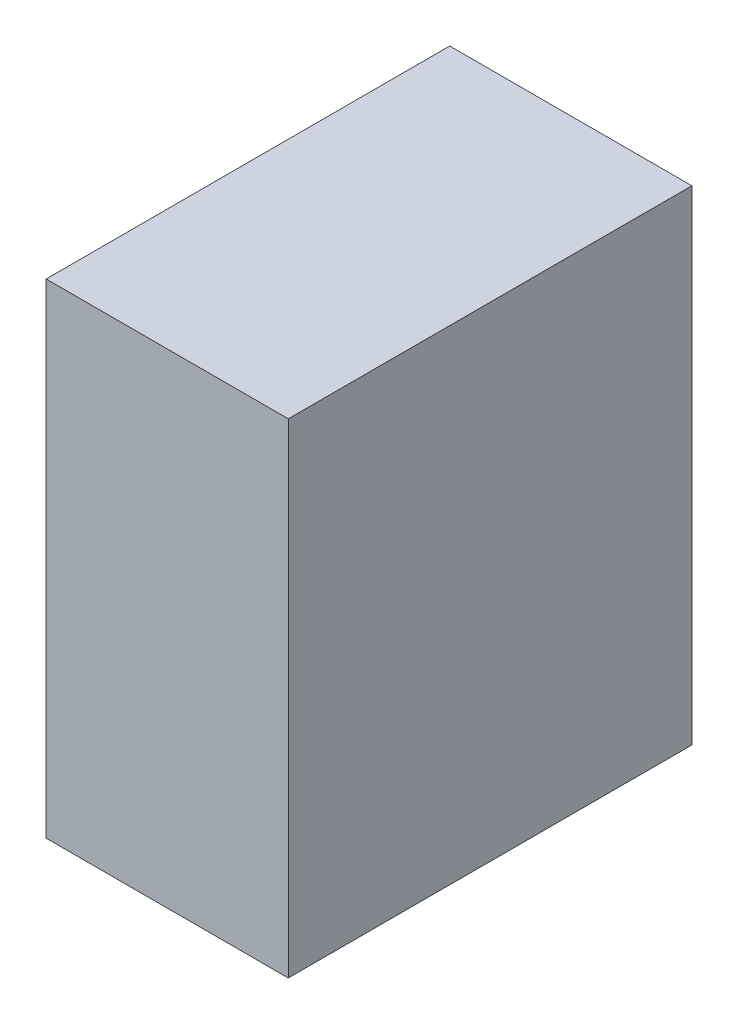
ISO-10303-21;
HEADER;
FILE_DESCRIPTION(('STEP AP214'),'2;1');
FILE_NAME('part.step','',(''),(''),'','','');
FILE_SCHEMA(('AUTOMOTIVE_DESIGN { 1 0 10303 214 1 1 1 1 }'));
ENDSEC;
DATA;
#1=APPLICATION_CONTEXT('core data for automotive mechanical design processes');
#2=APPLICATION_PROTOCOL_DEFINITION('international standard','automotive_design',2000,#1);
#3=PRODUCT_CONTEXT('',#1,'mechanical');
#4=PRODUCT('Part','Part','',(#3));
#5=PRODUCT_RELATED_PRODUCT_CATEGORY('part','',(#4));
#6=PRODUCT_DEFINITION_FORMATION('','',#4);
#7=PRODUCT_DEFINITION_CONTEXT('part definition',#1,'design');
#8=PRODUCT_DEFINITION('design','',#6,#7);
#9=PRODUCT_DEFINITION_SHAPE('','',#8);
#10=(LENGTH_UNIT() NAMED_UNIT(*) SI_UNIT(.MILLI.,.METRE.));
#11=(NAMED_UNIT(*) PLANE_ANGLE_UNIT() SI_UNIT($,.RADIAN.));
#12=(NAMED_UNIT(*) SI_UNIT($,.STERADIAN.) SOLID_ANGLE_UNIT());
#13=UNCERTAINTY_MEASURE_WITH_UNIT(LENGTH_MEASURE(1.E-05),#10,'distance_accuracy_value','');
#14=(GEOMETRIC_REPRESENTATION_CONTEXT(3) GLOBAL_UNCERTAINTY_ASSIGNED_CONTEXT((#13)) GLOBAL_UNIT_ASSIGNED_CONTEXT((#10,
#11,#12)) REPRESENTATION_CONTEXT('',''));
#15=CARTESIAN_POINT('',(0.,0.,0.));
#16=DIRECTION('',(0.,0.,1.));
#17=DIRECTION('',(1.,0.,0.));
#18=AXIS2_PLACEMENT_3D('',#15,#16,#17);
#19=CARTESIAN_POINT('',(38.1,152.4,-63.5));
#20=DIRECTION('',(-1.,0.,0.));
#21=DIRECTION('',(0.,0.,1.));
#22=AXIS2_PLACEMENT_3D('',#19,#20,#21);
#23=PLANE('',#22);
#24=DIRECTION('',(0.,0.,-1.));
#25=VECTOR('',#24,1.);
#26=CARTESIAN_POINT('',(38.1,0.,-63.5));
#27=LINE('',#26,#25);
#28=CARTESIAN_POINT('',(38.1,0.,63.5));
#29=VERTEX_POINT('',#28);
#30=CARTESIAN_POINT('',(38.1,0.,-63.5));
#31=VERTEX_POINT('',#30);
#32=EDGE_CURVE('E98',#29,#31,#27,.T.);
#33=ORIENTED_EDGE('',*,*,#32,.T.);
#34=DIRECTION('',(0.,-1.,0.));
#35=VECTOR('',#34,1.);
#36=CARTESIAN_POINT('',(38.1,152.4,-63.5));
#37=LINE('',#36,#35);
#38=CARTESIAN_POINT('',(38.1,152.4,-63.5));
#39=VERTEX_POINT('',#38);
#40=EDGE_CURVE('E11',#39,#31,#37,.T.);
#41=ORIENTED_EDGE('',*,*,#40,.F.);
#42=DIRECTION('',(0.,0.,-1.));
#43=VECTOR('',#42,1.);
#44=CARTESIAN_POINT('',(38.1,152.4,-63.5));
#45=LINE('',#44,#43);
#46=CARTESIAN_POINT('',(38.1,152.4,63.5));
#47=VERTEX_POINT('',#46);
#48=EDGE_CURVE('E86',#47,#39,#45,.T.);
#49=ORIENTED_EDGE('',*,*,#48,.F.);
#50=DIRECTION('',(0.,-1.,0.));
#51=VECTOR('',#50,1.);
#52=CARTESIAN_POINT('',(38.1,152.4,63.5));
#53=LINE('',#52,#51);
#54=EDGE_CURVE('E94',#47,#29,#53,.T.);
#55=ORIENTED_EDGE('',*,*,#54,.T.);
#56=EDGE_LOOP('',(#33,#41,#49,#55));
#57=FACE_BOUND('',#56,.T.);
#58=ADVANCED_FACE('F35',(#57),#23,.F.);
#59=CARTESIAN_POINT('',(-38.1,152.4,-63.5));
#60=DIRECTION('',(0.,0.,1.));
#61=DIRECTION('',(1.,0.,0.));
#62=AXIS2_PLACEMENT_3D('',#59,#60,#61);
#63=PLANE('',#62);
#64=DIRECTION('',(-1.,0.,0.));
#65=VECTOR('',#64,1.);
#66=CARTESIAN_POINT('',(-38.1,0.,-63.5));
#67=LINE('',#66,#65);
#68=CARTESIAN_POINT('',(-38.1,0.,-63.5));
#69=VERTEX_POINT('',#68);
#70=EDGE_CURVE('E90',#31,#69,#67,.T.);
#71=ORIENTED_EDGE('',*,*,#70,.T.);
#72=DIRECTION('',(0.,-1.,0.));
#73=VECTOR('',#72,1.);
#74=CARTESIAN_POINT('',(-38.1,152.4,-63.5));
#75=LINE('',#74,#73);
#76=CARTESIAN_POINT('',(-38.1,152.4,-63.5));
#77=VERTEX_POINT('',#76);
#78=EDGE_CURVE('E43',#77,#69,#75,.T.);
#79=ORIENTED_EDGE('',*,*,#78,.F.);
#80=DIRECTION('',(-1.,0.,0.));
#81=VECTOR('',#80,1.);
#82=CARTESIAN_POINT('',(-38.1,152.4,-63.5));
#83=LINE('',#82,#81);
#84=EDGE_CURVE('E81',#39,#77,#83,.T.);
#85=ORIENTED_EDGE('',*,*,#84,.F.);
#86=ORIENTED_EDGE('',*,*,#40,.T.);
#87=EDGE_LOOP('',(#71,#79,#85,#86));
#88=FACE_BOUND('',#87,.T.);
#89=ADVANCED_FACE('F89',(#88),#63,.F.);
#90=CARTESIAN_POINT('',(-38.1,152.4,-63.5));
#91=DIRECTION('',(1.,0.,0.));
#92=DIRECTION('',(0.,0.,-1.));
#93=AXIS2_PLACEMENT_3D('',#90,#91,#92);
#94=PLANE('',#93);
#95=DIRECTION('',(0.,0.,1.));
#96=VECTOR('',#95,1.);
#97=CARTESIAN_POINT('',(-38.1,0.,-63.5));
#98=LINE('',#97,#96);
#99=CARTESIAN_POINT('',(-38.1,0.,63.5));
#100=VERTEX_POINT('',#99);
#101=EDGE_CURVE('E68',#69,#100,#98,.T.);
#102=ORIENTED_EDGE('',*,*,#101,.T.);
#103=DIRECTION('',(0.,-1.,0.));
#104=VECTOR('',#103,1.);
#105=CARTESIAN_POINT('',(-38.1,152.4,63.5));
#106=LINE('',#105,#104);
#107=CARTESIAN_POINT('',(-38.1,152.4,63.5));
#108=VERTEX_POINT('',#107);
#109=EDGE_CURVE('E91',#108,#100,#106,.T.);
#110=ORIENTED_EDGE('',*,*,#109,.F.);
#111=DIRECTION('',(0.,0.,1.));
#112=VECTOR('',#111,1.);
#113=CARTESIAN_POINT('',(-38.1,152.4,-63.5));
#114=LINE('',#113,#112);
#115=EDGE_CURVE('E84',#77,#108,#114,.T.);
#116=ORIENTED_EDGE('',*,*,#115,.F.);
#117=ORIENTED_EDGE('',*,*,#78,.T.);
#118=EDGE_LOOP('',(#102,#110,#116,#117));
#119=FACE_BOUND('',#118,.T.);
#120=ADVANCED_FACE('F92',(#119),#94,.F.);
#121=CARTESIAN_POINT('',(-38.1,152.4,63.5));
#122=DIRECTION('',(0.,0.,-1.));
#123=DIRECTION('',(-1.,0.,0.));
#124=AXIS2_PLACEMENT_3D('',#121,#122,#123);
#125=PLANE('',#124);
#126=DIRECTION('',(1.,0.,0.));
#127=VECTOR('',#126,1.);
#128=CARTESIAN_POINT('',(-38.1,0.,63.5));
#129=LINE('',#128,#127);
#130=EDGE_CURVE('E74',#100,#29,#129,.T.);
#131=ORIENTED_EDGE('',*,*,#130,.T.);
#132=ORIENTED_EDGE('',*,*,#54,.F.);
#133=DIRECTION('',(1.,0.,0.));
#134=VECTOR('',#133,1.);
#135=CARTESIAN_POINT('',(-38.1,152.4,63.5));
#136=LINE('',#135,#134);
#137=EDGE_CURVE('E51',#108,#47,#136,.T.);
#138=ORIENTED_EDGE('',*,*,#137,.F.);
#139=ORIENTED_EDGE('',*,*,#109,.T.);
#140=EDGE_LOOP('',(#131,#132,#138,#139));
#141=FACE_BOUND('',#140,.T.);
#142=ADVANCED_FACE('F105',(#141),#125,.F.);
#143=CARTESIAN_POINT('',(0.,152.4,0.));
#144=DIRECTION('',(0.,1.,0.));
#145=DIRECTION('',(0.,0.,1.));
#146=AXIS2_PLACEMENT_3D('',#143,#144,#145);
#147=PLANE('',#146);
#148=ORIENTED_EDGE('',*,*,#48,.T.);
#149=ORIENTED_EDGE('',*,*,#84,.T.);
#150=ORIENTED_EDGE('',*,*,#115,.T.);
#151=ORIENTED_EDGE('',*,*,#137,.T.);
#152=EDGE_LOOP('',(#148,#149,#150,#151));
#153=FACE_BOUND('',#152,.T.);
#154=ADVANCED_FACE('F82',(#153),#147,.T.);
#155=CARTESIAN_POINT('',(0.,0.,0.));
#156=DIRECTION('',(0.,1.,0.));
#157=DIRECTION('',(0.,0.,1.));
#158=AXIS2_PLACEMENT_3D('',#155,#156,#157);
#159=PLANE('',#158);
#160=ORIENTED_EDGE('',*,*,#32,.F.);
#161=ORIENTED_EDGE('',*,*,#130,.F.);
#162=ORIENTED_EDGE('',*,*,#101,.F.);
#163=ORIENTED_EDGE('',*,*,#70,.F.);
#164=EDGE_LOOP('',(#160,#161,#162,#163));
#165=FACE_BOUND('',#164,.T.);
#166=ADVANCED_FACE('F108',(#165),#159,.F.);
#167=CLOSED_SHELL('',(#58,#89,#120,#142,#154,#166));
#168=MANIFOLD_SOLID_BREP('B2',#167);
#169=ADVANCED_BREP_SHAPE_REPRESENTATION('',(#18,#168),#14);
#170=SHAPE_DEFINITION_REPRESENTATION(#9,#169);
ENDSEC;
END-ISO-10303-21;
